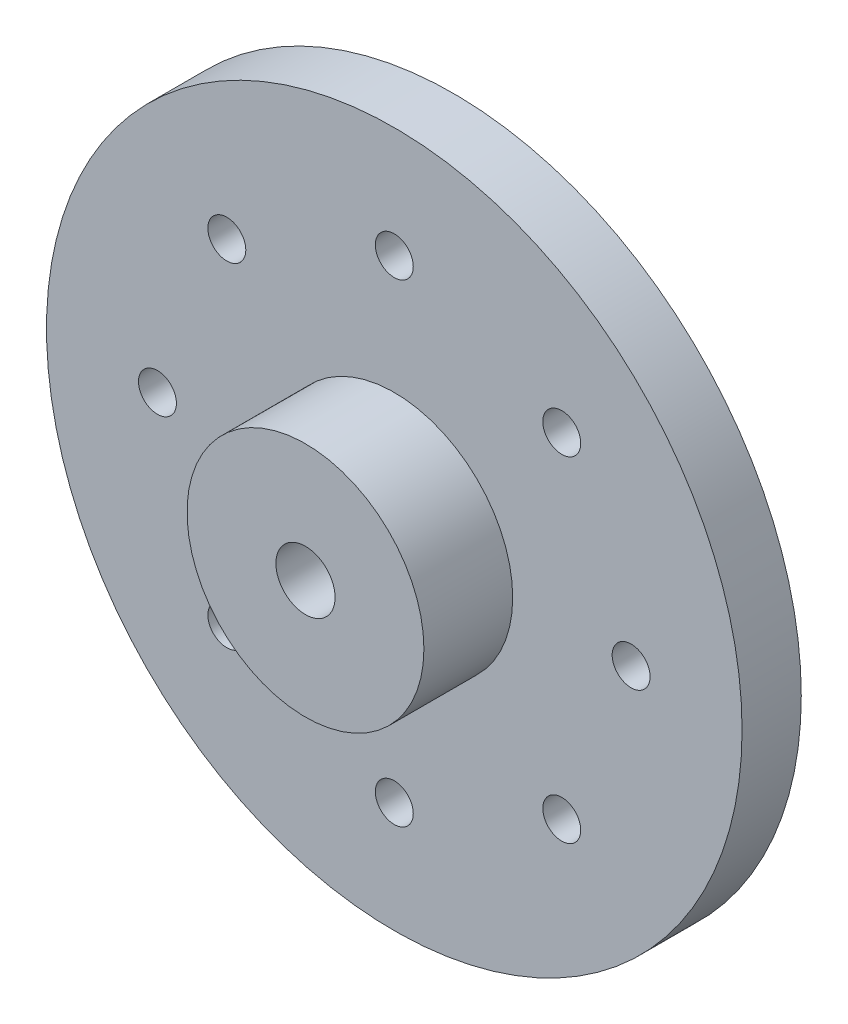
ISO-10303-21;
HEADER;
FILE_DESCRIPTION(('STEP AP214'),'2;1');
FILE_NAME('part.step','',(''),(''),'','','');
FILE_SCHEMA(('AUTOMOTIVE_DESIGN { 1 0 10303 214 1 1 1 1 }'));
ENDSEC;
DATA;
#1=APPLICATION_CONTEXT('core data for automotive mechanical design processes');
#2=APPLICATION_PROTOCOL_DEFINITION('international standard','automotive_design',2000,#1);
#3=PRODUCT_CONTEXT('',#1,'mechanical');
#4=PRODUCT('Part','Part','',(#3));
#5=PRODUCT_RELATED_PRODUCT_CATEGORY('part','',(#4));
#6=PRODUCT_DEFINITION_FORMATION('','',#4);
#7=PRODUCT_DEFINITION_CONTEXT('part definition',#1,'design');
#8=PRODUCT_DEFINITION('design','',#6,#7);
#9=PRODUCT_DEFINITION_SHAPE('','',#8);
#10=(LENGTH_UNIT() NAMED_UNIT(*) SI_UNIT(.MILLI.,.METRE.));
#11=(NAMED_UNIT(*) PLANE_ANGLE_UNIT() SI_UNIT($,.RADIAN.));
#12=(NAMED_UNIT(*) SI_UNIT($,.STERADIAN.) SOLID_ANGLE_UNIT());
#13=UNCERTAINTY_MEASURE_WITH_UNIT(LENGTH_MEASURE(1.E-05),#10,'distance_accuracy_value','');
#14=(GEOMETRIC_REPRESENTATION_CONTEXT(3) GLOBAL_UNCERTAINTY_ASSIGNED_CONTEXT((#13)) GLOBAL_UNIT_ASSIGNED_CONTEXT((#10,
#11,#12)) REPRESENTATION_CONTEXT('',''));
#15=CARTESIAN_POINT('',(0.,0.,0.));
#16=DIRECTION('',(0.,0.,1.));
#17=DIRECTION('',(1.,0.,0.));
#18=AXIS2_PLACEMENT_3D('',#15,#16,#17);
#19=CARTESIAN_POINT('',(0.,0.,0.));
#20=DIRECTION('',(0.,0.,1.));
#21=DIRECTION('',(1.,0.,0.));
#22=AXIS2_PLACEMENT_3D('',#19,#20,#21);
#23=PLANE('',#22);
#24=CARTESIAN_POINT('',(-5.65685424949228,5.65685424949214,0.));
#25=DIRECTION('',(0.,0.,1.));
#26=DIRECTION('',(1.,0.,0.));
#27=AXIS2_PLACEMENT_3D('',#24,#25,#26);
#28=CIRCLE('',#27,0.640765971643295);
#29=CARTESIAN_POINT('',(-5.01608827784899,5.65685424949214,0.));
#30=VERTEX_POINT('',#29);
#31=EDGE_CURVE('E98',#30,#30,#28,.T.);
#32=ORIENTED_EDGE('',*,*,#31,.T.);
#33=EDGE_LOOP('',(#32));
#34=FACE_BOUND('',#33,.T.);
#35=CARTESIAN_POINT('',(-7.99999999999966,-3.40601640478901E-13,0.));
#36=DIRECTION('',(0.,0.,1.));
#37=DIRECTION('',(1.,0.,0.));
#38=AXIS2_PLACEMENT_3D('',#35,#36,#37);
#39=CIRCLE('',#38,0.64076597164354);
#40=CARTESIAN_POINT('',(-7.35923402835612,-3.40601640478901E-13,0.));
#41=VERTEX_POINT('',#40);
#42=EDGE_CURVE('E92',#41,#41,#39,.T.);
#43=ORIENTED_EDGE('',*,*,#42,.T.);
#44=EDGE_LOOP('',(#43));
#45=FACE_BOUND('',#44,.T.);
#46=CARTESIAN_POINT('',(-5.6568542494918,-5.65685424949262,0.));
#47=DIRECTION('',(0.,0.,1.));
#48=DIRECTION('',(1.,0.,0.));
#49=AXIS2_PLACEMENT_3D('',#46,#47,#48);
#50=CIRCLE('',#49,0.640765971643727);
#51=CARTESIAN_POINT('',(-5.01608827784807,-5.65685424949262,0.));
#52=VERTEX_POINT('',#51);
#53=EDGE_CURVE('E86',#52,#52,#50,.T.);
#54=ORIENTED_EDGE('',*,*,#53,.T.);
#55=EDGE_LOOP('',(#54));
#56=FACE_BOUND('',#55,.T.);
#57=CARTESIAN_POINT('',(6.79702767299504E-13,-8.,0.));
#58=DIRECTION('',(0.,0.,1.));
#59=DIRECTION('',(1.,0.,0.));
#60=AXIS2_PLACEMENT_3D('',#57,#58,#59);
#61=CIRCLE('',#60,0.640765971643739);
#62=CARTESIAN_POINT('',(0.640765971644419,-8.,0.));
#63=VERTEX_POINT('',#62);
#64=EDGE_CURVE('E80',#63,#63,#61,.T.);
#65=ORIENTED_EDGE('',*,*,#64,.T.);
#66=EDGE_LOOP('',(#65));
#67=FACE_BOUND('',#66,.T.);
#68=CARTESIAN_POINT('',(5.65685424949296,-5.65685424949214,0.));
#69=DIRECTION('',(0.,0.,1.));
#70=DIRECTION('',(1.,0.,0.));
#71=AXIS2_PLACEMENT_3D('',#68,#69,#70);
#72=CIRCLE('',#71,0.64076597164356);
#73=CARTESIAN_POINT('',(6.29762022113652,-5.65685424949214,0.));
#74=VERTEX_POINT('',#73);
#75=EDGE_CURVE('E74',#74,#74,#72,.T.);
#76=ORIENTED_EDGE('',*,*,#75,.T.);
#77=EDGE_LOOP('',(#76));
#78=FACE_BOUND('',#77,.T.);
#79=CARTESIAN_POINT('',(8.00000000000034,3.39621923039584E-13,0.));
#80=DIRECTION('',(0.,0.,1.));
#81=DIRECTION('',(1.,0.,0.));
#82=AXIS2_PLACEMENT_3D('',#79,#80,#81);
#83=CIRCLE('',#82,0.640765971643287);
#84=CARTESIAN_POINT('',(8.64076597164363,3.39621923039584E-13,0.));
#85=VERTEX_POINT('',#84);
#86=EDGE_CURVE('E68',#85,#85,#83,.T.);
#87=ORIENTED_EDGE('',*,*,#86,.T.);
#88=EDGE_LOOP('',(#87));
#89=FACE_BOUND('',#88,.T.);
#90=CARTESIAN_POINT('',(5.65685424949248,5.65685424949262,0.));
#91=DIRECTION('',(0.,0.,1.));
#92=DIRECTION('',(1.,0.,0.));
#93=AXIS2_PLACEMENT_3D('',#90,#91,#92);
#94=CIRCLE('',#93,0.640765971643074);
#95=CARTESIAN_POINT('',(6.29762022113555,5.65685424949262,0.));
#96=VERTEX_POINT('',#95);
#97=EDGE_CURVE('E62',#96,#96,#94,.T.);
#98=ORIENTED_EDGE('',*,*,#97,.T.);
#99=EDGE_LOOP('',(#98));
#100=FACE_BOUND('',#99,.T.);
#101=CARTESIAN_POINT('',(0.,8.,0.));
#102=DIRECTION('',(0.,0.,1.));
#103=DIRECTION('',(1.,0.,0.));
#104=AXIS2_PLACEMENT_3D('',#101,#102,#103);
#105=CIRCLE('',#104,0.640765971643035);
#106=CARTESIAN_POINT('',(0.640765971643035,8.,0.));
#107=VERTEX_POINT('',#106);
#108=EDGE_CURVE('E56',#107,#107,#105,.T.);
#109=ORIENTED_EDGE('',*,*,#108,.T.);
#110=EDGE_LOOP('',(#109));
#111=FACE_BOUND('',#110,.T.);
#112=CARTESIAN_POINT('',(0.,0.,0.));
#113=DIRECTION('',(0.,0.,1.));
#114=DIRECTION('',(1.,0.,0.));
#115=AXIS2_PLACEMENT_3D('',#112,#113,#114);
#116=CIRCLE('',#115,11.747376146789);
#117=CARTESIAN_POINT('',(11.747376146789,0.,0.));
#118=VERTEX_POINT('',#117);
#119=EDGE_CURVE('E50',#118,#118,#116,.T.);
#120=ORIENTED_EDGE('',*,*,#119,.F.);
#121=EDGE_LOOP('',(#120));
#122=FACE_BOUND('',#121,.T.);
#123=CARTESIAN_POINT('',(0.,0.,0.));
#124=DIRECTION('',(0.,0.,1.));
#125=DIRECTION('',(1.,0.,0.));
#126=AXIS2_PLACEMENT_3D('',#123,#124,#125);
#127=CIRCLE('',#126,4.);
#128=CARTESIAN_POINT('',(4.,0.,0.));
#129=VERTEX_POINT('',#128);
#130=EDGE_CURVE('E43',#129,#129,#127,.F.);
#131=ORIENTED_EDGE('',*,*,#130,.F.);
#132=EDGE_LOOP('',(#131));
#133=FACE_BOUND('',#132,.T.);
#134=ADVANCED_FACE('F32',(#34,#45,#56,#67,#78,#89,#100,#111,#122,#133),#23,.F.);
#135=CARTESIAN_POINT('',(0.,0.,2.));
#136=DIRECTION('',(0.,0.,1.));
#137=DIRECTION('',(1.,0.,0.));
#138=AXIS2_PLACEMENT_3D('',#135,#136,#137);
#139=PLANE('',#138);
#140=CARTESIAN_POINT('',(-5.65685424949228,5.65685424949214,2.));
#141=DIRECTION('',(0.,0.,1.));
#142=DIRECTION('',(1.,0.,0.));
#143=AXIS2_PLACEMENT_3D('',#140,#141,#142);
#144=CIRCLE('',#143,0.640765971643295);
#145=CARTESIAN_POINT('',(-5.01608827784899,5.65685424949214,2.));
#146=VERTEX_POINT('',#145);
#147=EDGE_CURVE('E95',#146,#146,#144,.T.);
#148=ORIENTED_EDGE('',*,*,#147,.F.);
#149=EDGE_LOOP('',(#148));
#150=FACE_BOUND('',#149,.T.);
#151=CARTESIAN_POINT('',(-5.6568542494918,-5.65685424949262,2.));
#152=DIRECTION('',(0.,0.,1.));
#153=DIRECTION('',(1.,0.,0.));
#154=AXIS2_PLACEMENT_3D('',#151,#152,#153);
#155=CIRCLE('',#154,0.640765971643727);
#156=CARTESIAN_POINT('',(-5.01608827784807,-5.65685424949262,2.));
#157=VERTEX_POINT('',#156);
#158=EDGE_CURVE('E83',#157,#157,#155,.T.);
#159=ORIENTED_EDGE('',*,*,#158,.F.);
#160=EDGE_LOOP('',(#159));
#161=FACE_BOUND('',#160,.T.);
#162=CARTESIAN_POINT('',(5.65685424949296,-5.65685424949214,2.));
#163=DIRECTION('',(0.,0.,1.));
#164=DIRECTION('',(1.,0.,0.));
#165=AXIS2_PLACEMENT_3D('',#162,#163,#164);
#166=CIRCLE('',#165,0.64076597164356);
#167=CARTESIAN_POINT('',(6.29762022113652,-5.65685424949214,2.));
#168=VERTEX_POINT('',#167);
#169=EDGE_CURVE('E71',#168,#168,#166,.T.);
#170=ORIENTED_EDGE('',*,*,#169,.F.);
#171=EDGE_LOOP('',(#170));
#172=FACE_BOUND('',#171,.T.);
#173=CARTESIAN_POINT('',(5.65685424949248,5.65685424949262,2.));
#174=DIRECTION('',(0.,0.,1.));
#175=DIRECTION('',(1.,0.,0.));
#176=AXIS2_PLACEMENT_3D('',#173,#174,#175);
#177=CIRCLE('',#176,0.640765971643074);
#178=CARTESIAN_POINT('',(6.29762022113555,5.65685424949262,2.));
#179=VERTEX_POINT('',#178);
#180=EDGE_CURVE('E59',#179,#179,#177,.T.);
#181=ORIENTED_EDGE('',*,*,#180,.F.);
#182=EDGE_LOOP('',(#181));
#183=FACE_BOUND('',#182,.T.);
#184=CARTESIAN_POINT('',(0.,0.,2.));
#185=DIRECTION('',(0.,0.,1.));
#186=DIRECTION('',(1.,0.,0.));
#187=AXIS2_PLACEMENT_3D('',#184,#185,#186);
#188=CIRCLE('',#187,11.747376146789);
#189=CARTESIAN_POINT('',(11.747376146789,0.,2.));
#190=VERTEX_POINT('',#189);
#191=EDGE_CURVE('E47',#190,#190,#188,.T.);
#192=ORIENTED_EDGE('',*,*,#191,.T.);
#193=EDGE_LOOP('',(#192));
#194=FACE_BOUND('',#193,.T.);
#195=CARTESIAN_POINT('',(0.,8.,2.));
#196=DIRECTION('',(0.,0.,1.));
#197=DIRECTION('',(1.,0.,0.));
#198=AXIS2_PLACEMENT_3D('',#195,#196,#197);
#199=CIRCLE('',#198,0.640765971643035);
#200=CARTESIAN_POINT('',(0.640765971643035,8.,2.));
#201=VERTEX_POINT('',#200);
#202=EDGE_CURVE('E53',#201,#201,#199,.T.);
#203=ORIENTED_EDGE('',*,*,#202,.F.);
#204=EDGE_LOOP('',(#203));
#205=FACE_BOUND('',#204,.T.);
#206=CARTESIAN_POINT('',(8.00000000000034,3.39621923039584E-13,2.));
#207=DIRECTION('',(0.,0.,1.));
#208=DIRECTION('',(1.,0.,0.));
#209=AXIS2_PLACEMENT_3D('',#206,#207,#208);
#210=CIRCLE('',#209,0.640765971643287);
#211=CARTESIAN_POINT('',(8.64076597164363,3.39621923039584E-13,2.));
#212=VERTEX_POINT('',#211);
#213=EDGE_CURVE('E65',#212,#212,#210,.T.);
#214=ORIENTED_EDGE('',*,*,#213,.F.);
#215=EDGE_LOOP('',(#214));
#216=FACE_BOUND('',#215,.T.);
#217=CARTESIAN_POINT('',(6.79702767299504E-13,-8.,2.));
#218=DIRECTION('',(0.,0.,1.));
#219=DIRECTION('',(1.,0.,0.));
#220=AXIS2_PLACEMENT_3D('',#217,#218,#219);
#221=CIRCLE('',#220,0.640765971643739);
#222=CARTESIAN_POINT('',(0.640765971644419,-8.,2.));
#223=VERTEX_POINT('',#222);
#224=EDGE_CURVE('E77',#223,#223,#221,.T.);
#225=ORIENTED_EDGE('',*,*,#224,.F.);
#226=EDGE_LOOP('',(#225));
#227=FACE_BOUND('',#226,.T.);
#228=CARTESIAN_POINT('',(-7.99999999999966,-3.40601640478901E-13,2.));
#229=DIRECTION('',(0.,0.,1.));
#230=DIRECTION('',(1.,0.,0.));
#231=AXIS2_PLACEMENT_3D('',#228,#229,#230);
#232=CIRCLE('',#231,0.64076597164354);
#233=CARTESIAN_POINT('',(-7.35923402835612,-3.40601640478901E-13,2.));
#234=VERTEX_POINT('',#233);
#235=EDGE_CURVE('E89',#234,#234,#232,.T.);
#236=ORIENTED_EDGE('',*,*,#235,.F.);
#237=EDGE_LOOP('',(#236));
#238=FACE_BOUND('',#237,.T.);
#239=CARTESIAN_POINT('',(0.,0.,2.));
#240=DIRECTION('',(0.,0.,1.));
#241=DIRECTION('',(1.,0.,0.));
#242=AXIS2_PLACEMENT_3D('',#239,#240,#241);
#243=CIRCLE('',#242,4.);
#244=CARTESIAN_POINT('',(4.,0.,2.));
#245=VERTEX_POINT('',#244);
#246=EDGE_CURVE('E107',#245,#245,#243,.T.);
#247=ORIENTED_EDGE('',*,*,#246,.F.);
#248=EDGE_LOOP('',(#247));
#249=FACE_BOUND('',#248,.T.);
#250=ADVANCED_FACE('F138',(#150,#161,#172,#183,#194,#205,#216,#227,#238,#249),#139,.T.);
#251=CARTESIAN_POINT('',(0.,0.,2.));
#252=DIRECTION('',(0.,0.,-1.));
#253=DIRECTION('',(-1.,0.,0.));
#254=AXIS2_PLACEMENT_3D('',#251,#252,#253);
#255=CYLINDRICAL_SURFACE('',#254,11.747376146789);
#256=ORIENTED_EDGE('',*,*,#191,.F.);
#257=EDGE_LOOP('',(#256));
#258=FACE_BOUND('',#257,.T.);
#259=ORIENTED_EDGE('',*,*,#119,.T.);
#260=EDGE_LOOP('',(#259));
#261=FACE_BOUND('',#260,.T.);
#262=ADVANCED_FACE('F144',(#258,#261),#255,.T.);
#263=CARTESIAN_POINT('',(0.,0.,2.));
#264=DIRECTION('',(0.,0.,-1.));
#265=DIRECTION('',(-1.,0.,0.));
#266=AXIS2_PLACEMENT_3D('',#263,#264,#265);
#267=CYLINDRICAL_SURFACE('',#266,2.66985821517932);
#268=CARTESIAN_POINT('',(0.,0.,2.));
#269=DIRECTION('',(0.,0.,1.));
#270=DIRECTION('',(1.,0.,0.));
#271=AXIS2_PLACEMENT_3D('',#268,#269,#270);
#272=CIRCLE('',#271,2.66985821517932);
#273=CARTESIAN_POINT('',(2.66985821517932,0.,2.));
#274=VERTEX_POINT('',#273);
#275=EDGE_CURVE('E101',#274,#274,#272,.T.);
#276=ORIENTED_EDGE('',*,*,#275,.T.);
#277=EDGE_LOOP('',(#276));
#278=FACE_BOUND('',#277,.T.);
#279=CARTESIAN_POINT('',(0.,0.,-1.));
#280=DIRECTION('',(0.,0.,-1.));
#281=DIRECTION('',(-1.,0.,0.));
#282=AXIS2_PLACEMENT_3D('',#279,#280,#281);
#283=CIRCLE('',#282,2.66985821517932);
#284=CARTESIAN_POINT('',(-2.66985821517932,0.,-1.));
#285=VERTEX_POINT('',#284);
#286=EDGE_CURVE('E116',#285,#285,#283,.T.);
#287=ORIENTED_EDGE('',*,*,#286,.T.);
#288=EDGE_LOOP('',(#287));
#289=FACE_BOUND('',#288,.T.);
#290=ADVANCED_FACE('F122',(#278,#289),#267,.F.);
#291=CARTESIAN_POINT('',(0.,8.,2.));
#292=DIRECTION('',(0.,0.,-1.));
#293=DIRECTION('',(-1.,0.,0.));
#294=AXIS2_PLACEMENT_3D('',#291,#292,#293);
#295=CYLINDRICAL_SURFACE('',#294,0.640765971643035);
#296=ORIENTED_EDGE('',*,*,#202,.T.);
#297=EDGE_LOOP('',(#296));
#298=FACE_BOUND('',#297,.T.);
#299=ORIENTED_EDGE('',*,*,#108,.F.);
#300=EDGE_LOOP('',(#299));
#301=FACE_BOUND('',#300,.T.);
#302=ADVANCED_FACE('F154',(#298,#301),#295,.F.);
#303=CARTESIAN_POINT('',(5.65685424949248,5.65685424949262,2.));
#304=DIRECTION('',(0.,0.,-1.));
#305=DIRECTION('',(-1.,0.,0.));
#306=AXIS2_PLACEMENT_3D('',#303,#304,#305);
#307=CYLINDRICAL_SURFACE('',#306,0.640765971643074);
#308=ORIENTED_EDGE('',*,*,#180,.T.);
#309=EDGE_LOOP('',(#308));
#310=FACE_BOUND('',#309,.T.);
#311=ORIENTED_EDGE('',*,*,#97,.F.);
#312=EDGE_LOOP('',(#311));
#313=FACE_BOUND('',#312,.T.);
#314=ADVANCED_FACE('F211',(#310,#313),#307,.F.);
#315=CARTESIAN_POINT('',(8.00000000000034,3.39621923039584E-13,2.));
#316=DIRECTION('',(0.,0.,-1.));
#317=DIRECTION('',(-1.,0.,0.));
#318=AXIS2_PLACEMENT_3D('',#315,#316,#317);
#319=CYLINDRICAL_SURFACE('',#318,0.640765971643287);
#320=ORIENTED_EDGE('',*,*,#213,.T.);
#321=EDGE_LOOP('',(#320));
#322=FACE_BOUND('',#321,.T.);
#323=ORIENTED_EDGE('',*,*,#86,.F.);
#324=EDGE_LOOP('',(#323));
#325=FACE_BOUND('',#324,.T.);
#326=ADVANCED_FACE('F207',(#322,#325),#319,.F.);
#327=CARTESIAN_POINT('',(5.65685424949296,-5.65685424949214,2.));
#328=DIRECTION('',(0.,0.,-1.));
#329=DIRECTION('',(-1.,0.,0.));
#330=AXIS2_PLACEMENT_3D('',#327,#328,#329);
#331=CYLINDRICAL_SURFACE('',#330,0.64076597164356);
#332=ORIENTED_EDGE('',*,*,#169,.T.);
#333=EDGE_LOOP('',(#332));
#334=FACE_BOUND('',#333,.T.);
#335=ORIENTED_EDGE('',*,*,#75,.F.);
#336=EDGE_LOOP('',(#335));
#337=FACE_BOUND('',#336,.T.);
#338=ADVANCED_FACE('F203',(#334,#337),#331,.F.);
#339=CARTESIAN_POINT('',(6.79702767299504E-13,-8.,2.));
#340=DIRECTION('',(0.,0.,-1.));
#341=DIRECTION('',(-1.,0.,0.));
#342=AXIS2_PLACEMENT_3D('',#339,#340,#341);
#343=CYLINDRICAL_SURFACE('',#342,0.640765971643739);
#344=ORIENTED_EDGE('',*,*,#224,.T.);
#345=EDGE_LOOP('',(#344));
#346=FACE_BOUND('',#345,.T.);
#347=ORIENTED_EDGE('',*,*,#64,.F.);
#348=EDGE_LOOP('',(#347));
#349=FACE_BOUND('',#348,.T.);
#350=ADVANCED_FACE('F199',(#346,#349),#343,.F.);
#351=CARTESIAN_POINT('',(-5.6568542494918,-5.65685424949262,2.));
#352=DIRECTION('',(0.,0.,-1.));
#353=DIRECTION('',(-1.,0.,0.));
#354=AXIS2_PLACEMENT_3D('',#351,#352,#353);
#355=CYLINDRICAL_SURFACE('',#354,0.640765971643727);
#356=ORIENTED_EDGE('',*,*,#158,.T.);
#357=EDGE_LOOP('',(#356));
#358=FACE_BOUND('',#357,.T.);
#359=ORIENTED_EDGE('',*,*,#53,.F.);
#360=EDGE_LOOP('',(#359));
#361=FACE_BOUND('',#360,.T.);
#362=ADVANCED_FACE('F195',(#358,#361),#355,.F.);
#363=CARTESIAN_POINT('',(-7.99999999999966,-3.40601640478901E-13,2.));
#364=DIRECTION('',(0.,0.,-1.));
#365=DIRECTION('',(-1.,0.,0.));
#366=AXIS2_PLACEMENT_3D('',#363,#364,#365);
#367=CYLINDRICAL_SURFACE('',#366,0.64076597164354);
#368=ORIENTED_EDGE('',*,*,#235,.T.);
#369=EDGE_LOOP('',(#368));
#370=FACE_BOUND('',#369,.T.);
#371=ORIENTED_EDGE('',*,*,#42,.F.);
#372=EDGE_LOOP('',(#371));
#373=FACE_BOUND('',#372,.T.);
#374=ADVANCED_FACE('F191',(#370,#373),#367,.F.);
#375=CARTESIAN_POINT('',(-5.65685424949228,5.65685424949214,2.));
#376=DIRECTION('',(0.,0.,-1.));
#377=DIRECTION('',(-1.,0.,0.));
#378=AXIS2_PLACEMENT_3D('',#375,#376,#377);
#379=CYLINDRICAL_SURFACE('',#378,0.640765971643295);
#380=ORIENTED_EDGE('',*,*,#147,.T.);
#381=EDGE_LOOP('',(#380));
#382=FACE_BOUND('',#381,.T.);
#383=ORIENTED_EDGE('',*,*,#31,.F.);
#384=EDGE_LOOP('',(#383));
#385=FACE_BOUND('',#384,.T.);
#386=ADVANCED_FACE('F188',(#382,#385),#379,.F.);
#387=CARTESIAN_POINT('',(0.,0.,5.));
#388=DIRECTION('',(0.,0.,1.));
#389=DIRECTION('',(1.,0.,0.));
#390=AXIS2_PLACEMENT_3D('',#387,#388,#389);
#391=PLANE('',#390);
#392=CARTESIAN_POINT('',(0.,0.,5.));
#393=DIRECTION('',(0.,0.,1.));
#394=DIRECTION('',(1.,0.,0.));
#395=AXIS2_PLACEMENT_3D('',#392,#393,#394);
#396=CIRCLE('',#395,4.);
#397=CARTESIAN_POINT('',(4.,0.,5.));
#398=VERTEX_POINT('',#397);
#399=EDGE_CURVE('E106',#398,#398,#396,.T.);
#400=ORIENTED_EDGE('',*,*,#399,.T.);
#401=EDGE_LOOP('',(#400));
#402=FACE_BOUND('',#401,.T.);
#403=CARTESIAN_POINT('',(0.,0.,5.));
#404=DIRECTION('',(0.,0.,1.));
#405=DIRECTION('',(1.,0.,0.));
#406=AXIS2_PLACEMENT_3D('',#403,#404,#405);
#407=CIRCLE('',#406,1.);
#408=CARTESIAN_POINT('',(1.,0.,5.));
#409=VERTEX_POINT('',#408);
#410=EDGE_CURVE('E110',#409,#409,#407,.T.);
#411=ORIENTED_EDGE('',*,*,#410,.F.);
#412=EDGE_LOOP('',(#411));
#413=FACE_BOUND('',#412,.T.);
#414=ADVANCED_FACE('F182',(#402,#413),#391,.T.);
#415=CARTESIAN_POINT('',(0.,0.,2.));
#416=DIRECTION('',(0.,0.,1.));
#417=DIRECTION('',(1.,0.,0.));
#418=AXIS2_PLACEMENT_3D('',#415,#416,#417);
#419=PLANE('',#418);
#420=ORIENTED_EDGE('',*,*,#275,.F.);
#421=EDGE_LOOP('',(#420));
#422=FACE_BOUND('',#421,.T.);
#423=CARTESIAN_POINT('',(0.,0.,2.));
#424=DIRECTION('',(0.,0.,1.));
#425=DIRECTION('',(1.,0.,0.));
#426=AXIS2_PLACEMENT_3D('',#423,#424,#425);
#427=CIRCLE('',#426,1.);
#428=CARTESIAN_POINT('',(1.,0.,2.));
#429=VERTEX_POINT('',#428);
#430=EDGE_CURVE('E113',#429,#429,#427,.T.);
#431=ORIENTED_EDGE('',*,*,#430,.T.);
#432=EDGE_LOOP('',(#431));
#433=FACE_BOUND('',#432,.T.);
#434=ADVANCED_FACE('F176',(#422,#433),#419,.F.);
#435=CARTESIAN_POINT('',(0.,0.,5.));
#436=DIRECTION('',(0.,0.,-1.));
#437=DIRECTION('',(-1.,0.,0.));
#438=AXIS2_PLACEMENT_3D('',#435,#436,#437);
#439=CYLINDRICAL_SURFACE('',#438,4.);
#440=ORIENTED_EDGE('',*,*,#399,.F.);
#441=EDGE_LOOP('',(#440));
#442=FACE_BOUND('',#441,.T.);
#443=ORIENTED_EDGE('',*,*,#246,.T.);
#444=EDGE_LOOP('',(#443));
#445=FACE_BOUND('',#444,.T.);
#446=ADVANCED_FACE('F134',(#442,#445),#439,.T.);
#447=CARTESIAN_POINT('',(0.,0.,5.));
#448=DIRECTION('',(0.,0.,-1.));
#449=DIRECTION('',(-1.,0.,0.));
#450=AXIS2_PLACEMENT_3D('',#447,#448,#449);
#451=CYLINDRICAL_SURFACE('',#450,1.);
#452=ORIENTED_EDGE('',*,*,#410,.T.);
#453=EDGE_LOOP('',(#452));
#454=FACE_BOUND('',#453,.T.);
#455=ORIENTED_EDGE('',*,*,#430,.F.);
#456=EDGE_LOOP('',(#455));
#457=FACE_BOUND('',#456,.T.);
#458=ADVANCED_FACE('F127',(#454,#457),#451,.F.);
#459=CARTESIAN_POINT('',(0.,0.,-1.));
#460=DIRECTION('',(0.,0.,-1.));
#461=DIRECTION('',(-1.,0.,0.));
#462=AXIS2_PLACEMENT_3D('',#459,#460,#461);
#463=PLANE('',#462);
#464=CARTESIAN_POINT('',(0.,0.,-1.));
#465=DIRECTION('',(0.,0.,-1.));
#466=DIRECTION('',(-1.,0.,0.));
#467=AXIS2_PLACEMENT_3D('',#464,#465,#466);
#468=CIRCLE('',#467,3.4);
#469=CARTESIAN_POINT('',(-3.4,0.,-1.));
#470=VERTEX_POINT('',#469);
#471=EDGE_CURVE('E39',#470,#470,#468,.T.);
#472=ORIENTED_EDGE('',*,*,#471,.T.);
#473=EDGE_LOOP('',(#472));
#474=FACE_BOUND('',#473,.T.);
#475=ORIENTED_EDGE('',*,*,#286,.F.);
#476=EDGE_LOOP('',(#475));
#477=FACE_BOUND('',#476,.T.);
#478=ADVANCED_FACE('F124',(#474,#477),#463,.T.);
#479=CARTESIAN_POINT('',(0.,0.,-1.));
#480=DIRECTION('',(0.,0.,1.));
#481=DIRECTION('',(1.,0.,0.));
#482=AXIS2_PLACEMENT_3D('',#479,#480,#481);
#483=CYLINDRICAL_SURFACE('',#482,4.);
#484=CARTESIAN_POINT('',(0.,0.,-0.400000000000002));
#485=DIRECTION('',(0.,0.,-1.));
#486=DIRECTION('',(-1.,0.,0.));
#487=AXIS2_PLACEMENT_3D('',#484,#485,#486);
#488=CIRCLE('',#487,4.);
#489=CARTESIAN_POINT('',(-4.,0.,-0.400000000000002));
#490=VERTEX_POINT('',#489);
#491=EDGE_CURVE('E10',#490,#490,#488,.F.);
#492=ORIENTED_EDGE('',*,*,#491,.T.);
#493=EDGE_LOOP('',(#492));
#494=FACE_BOUND('',#493,.T.);
#495=ORIENTED_EDGE('',*,*,#130,.T.);
#496=EDGE_LOOP('',(#495));
#497=FACE_BOUND('',#496,.T.);
#498=ADVANCED_FACE('F126',(#494,#497),#483,.T.);
#499=CARTESIAN_POINT('',(0.,0.,-1.));
#500=DIRECTION('',(0.,0.,1.));
#501=DIRECTION('',(1.,0.,0.));
#502=AXIS2_PLACEMENT_3D('',#499,#500,#501);
#503=CONICAL_SURFACE('',#502,3.4,0.78539816339745);
#504=ORIENTED_EDGE('',*,*,#491,.F.);
#505=EDGE_LOOP('',(#504));
#506=FACE_BOUND('',#505,.T.);
#507=ORIENTED_EDGE('',*,*,#471,.F.);
#508=EDGE_LOOP('',(#507));
#509=FACE_BOUND('',#508,.T.);
#510=ADVANCED_FACE('F34',(#506,#509),#503,.T.);
#511=CLOSED_SHELL('',(#134,#250,#262,#290,#302,#314,#326,#338,#350,#362,#374,#386,#414,#434,
#446,#458,#478,#498,#510));
#512=MANIFOLD_SOLID_BREP('B2',#511);
#513=ADVANCED_BREP_SHAPE_REPRESENTATION('',(#18,#512),#14);
#514=SHAPE_DEFINITION_REPRESENTATION(#9,#513);
ENDSEC;
END-ISO-10303-21;
